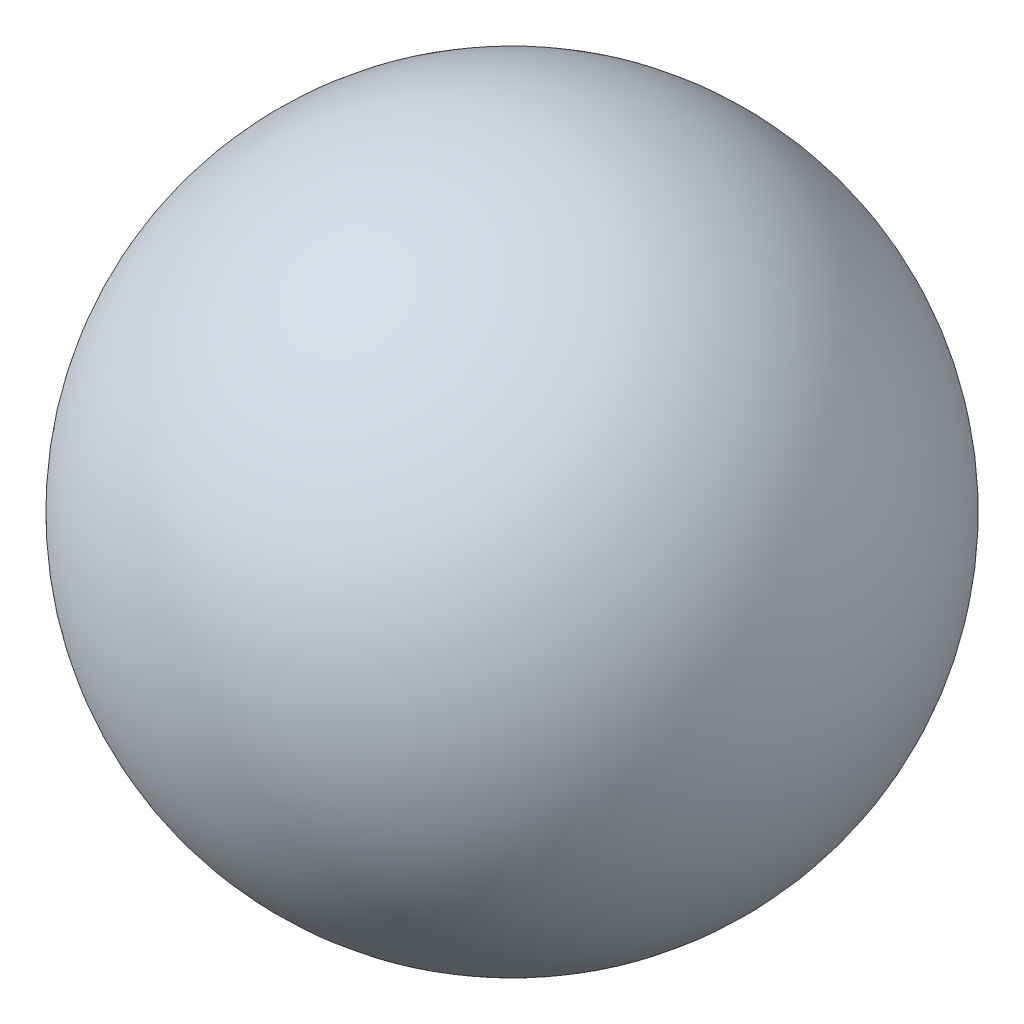
ISO-10303-21;
HEADER;
FILE_DESCRIPTION(('STEP AP214'),'2;1');
FILE_NAME('part.step','',(''),(''),'','','');
FILE_SCHEMA(('AUTOMOTIVE_DESIGN { 1 0 10303 214 1 1 1 1 }'));
ENDSEC;
DATA;
#1=APPLICATION_CONTEXT('core data for automotive mechanical design processes');
#2=APPLICATION_PROTOCOL_DEFINITION('international standard','automotive_design',2000,#1);
#3=PRODUCT_CONTEXT('',#1,'mechanical');
#4=PRODUCT('Part','Part','',(#3));
#5=PRODUCT_RELATED_PRODUCT_CATEGORY('part','',(#4));
#6=PRODUCT_DEFINITION_FORMATION('','',#4);
#7=PRODUCT_DEFINITION_CONTEXT('part definition',#1,'design');
#8=PRODUCT_DEFINITION('design','',#6,#7);
#9=PRODUCT_DEFINITION_SHAPE('','',#8);
#10=(LENGTH_UNIT() NAMED_UNIT(*) SI_UNIT(.MILLI.,.METRE.));
#11=(NAMED_UNIT(*) PLANE_ANGLE_UNIT() SI_UNIT($,.RADIAN.));
#12=(NAMED_UNIT(*) SI_UNIT($,.STERADIAN.) SOLID_ANGLE_UNIT());
#13=UNCERTAINTY_MEASURE_WITH_UNIT(LENGTH_MEASURE(1.E-05),#10,'distance_accuracy_value','');
#14=(GEOMETRIC_REPRESENTATION_CONTEXT(3) GLOBAL_UNCERTAINTY_ASSIGNED_CONTEXT((#13)) GLOBAL_UNIT_ASSIGNED_CONTEXT((#10,
#11,#12)) REPRESENTATION_CONTEXT('',''));
#15=CARTESIAN_POINT('',(0.,0.,0.));
#16=DIRECTION('',(0.,0.,1.));
#17=DIRECTION('',(1.,0.,0.));
#18=AXIS2_PLACEMENT_3D('',#15,#16,#17);
#19=CARTESIAN_POINT('',(-1.76057970376242,0.,0.));
#20=DIRECTION('',(0.,1.,0.));
#21=DIRECTION('',(1.,0.,0.));
#22=AXIS2_PLACEMENT_3D('',#19,#20,#21);
#23=SPHERICAL_SURFACE('',#22,21.);
#24=CARTESIAN_POINT('',(-1.76057970376242,21.,0.));
#25=VERTEX_POINT('',#24);
#26=VERTEX_LOOP('',#25);
#27=FACE_BOUND('',#26,.T.);
#28=ADVANCED_FACE('F37',(#27),#23,.T.);
#29=CLOSED_SHELL('',(#28));
#30=MANIFOLD_SOLID_BREP('B2',#29);
#31=ADVANCED_BREP_SHAPE_REPRESENTATION('',(#18,#30),#14);
#32=SHAPE_DEFINITION_REPRESENTATION(#9,#31);
ENDSEC;
END-ISO-10303-21;
